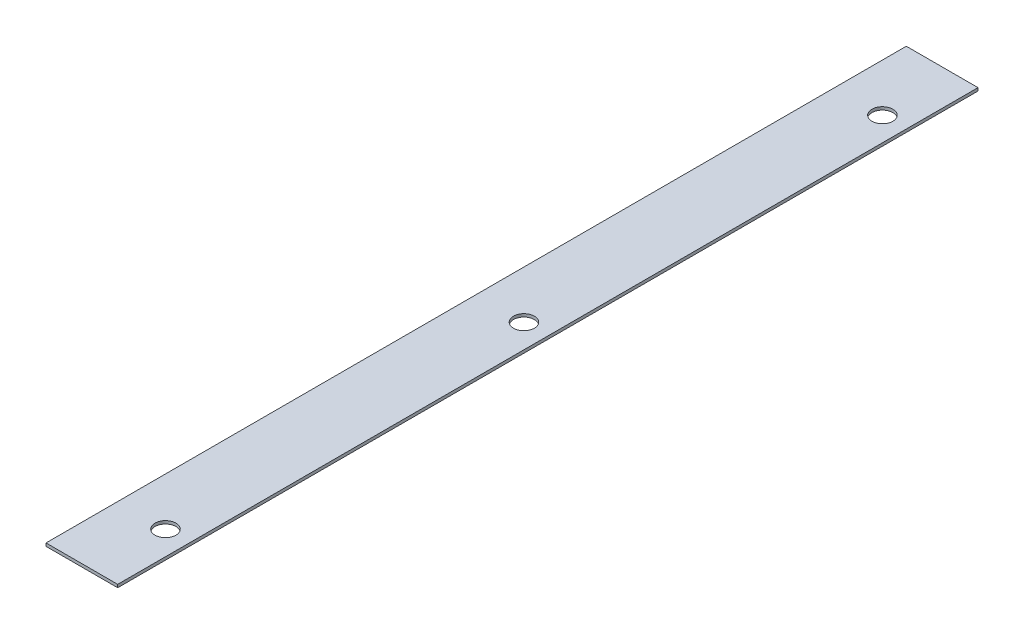
ISO-10303-21;
HEADER;
FILE_DESCRIPTION(('STEP AP214'),'2;1');
FILE_NAME('part.step','',(''),(''),'','','');
FILE_SCHEMA(('AUTOMOTIVE_DESIGN { 1 0 10303 214 1 1 1 1 }'));
ENDSEC;
DATA;
#1=APPLICATION_CONTEXT('core data for automotive mechanical design processes');
#2=APPLICATION_PROTOCOL_DEFINITION('international standard','automotive_design',2000,#1);
#3=PRODUCT_CONTEXT('',#1,'mechanical');
#4=PRODUCT('Part','Part','',(#3));
#5=PRODUCT_RELATED_PRODUCT_CATEGORY('part','',(#4));
#6=PRODUCT_DEFINITION_FORMATION('','',#4);
#7=PRODUCT_DEFINITION_CONTEXT('part definition',#1,'design');
#8=PRODUCT_DEFINITION('design','',#6,#7);
#9=PRODUCT_DEFINITION_SHAPE('','',#8);
#10=(LENGTH_UNIT() NAMED_UNIT(*) SI_UNIT(.MILLI.,.METRE.));
#11=(NAMED_UNIT(*) PLANE_ANGLE_UNIT() SI_UNIT($,.RADIAN.));
#12=(NAMED_UNIT(*) SI_UNIT($,.STERADIAN.) SOLID_ANGLE_UNIT());
#13=UNCERTAINTY_MEASURE_WITH_UNIT(LENGTH_MEASURE(1.E-05),#10,'distance_accuracy_value','');
#14=(GEOMETRIC_REPRESENTATION_CONTEXT(3) GLOBAL_UNCERTAINTY_ASSIGNED_CONTEXT((#13)) GLOBAL_UNIT_ASSIGNED_CONTEXT((#10,
#11,#12)) REPRESENTATION_CONTEXT('',''));
#15=CARTESIAN_POINT('',(0.,0.,0.));
#16=DIRECTION('',(0.,0.,1.));
#17=DIRECTION('',(1.,0.,0.));
#18=AXIS2_PLACEMENT_3D('',#15,#16,#17);
#19=CARTESIAN_POINT('',(0.,3.175,0.));
#20=DIRECTION('',(1.,0.,0.));
#21=DIRECTION('',(0.,0.,-1.));
#22=AXIS2_PLACEMENT_3D('',#19,#20,#21);
#23=PLANE('',#22);
#24=DIRECTION('',(0.,0.,1.));
#25=VECTOR('',#24,1.);
#26=CARTESIAN_POINT('',(0.,0.,0.));
#27=LINE('',#26,#25);
#28=CARTESIAN_POINT('',(0.,0.,-914.4));
#29=VERTEX_POINT('',#28);
#30=CARTESIAN_POINT('',(0.,0.,0.));
#31=VERTEX_POINT('',#30);
#32=EDGE_CURVE('E97',#29,#31,#27,.T.);
#33=ORIENTED_EDGE('',*,*,#32,.T.);
#34=DIRECTION('',(0.,-1.,0.));
#35=VECTOR('',#34,1.);
#36=CARTESIAN_POINT('',(0.,3.175,0.));
#37=LINE('',#36,#35);
#38=CARTESIAN_POINT('',(0.,3.175,0.));
#39=VERTEX_POINT('',#38);
#40=EDGE_CURVE('E11',#39,#31,#37,.T.);
#41=ORIENTED_EDGE('',*,*,#40,.F.);
#42=DIRECTION('',(0.,0.,1.));
#43=VECTOR('',#42,1.);
#44=CARTESIAN_POINT('',(0.,3.175,0.));
#45=LINE('',#44,#43);
#46=CARTESIAN_POINT('',(0.,3.175,-914.4));
#47=VERTEX_POINT('',#46);
#48=EDGE_CURVE('E85',#47,#39,#45,.T.);
#49=ORIENTED_EDGE('',*,*,#48,.F.);
#50=DIRECTION('',(0.,-1.,0.));
#51=VECTOR('',#50,1.);
#52=CARTESIAN_POINT('',(0.,3.175,-914.4));
#53=LINE('',#52,#51);
#54=EDGE_CURVE('E93',#47,#29,#53,.T.);
#55=ORIENTED_EDGE('',*,*,#54,.T.);
#56=EDGE_LOOP('',(#33,#41,#49,#55));
#57=FACE_BOUND('',#56,.T.);
#58=ADVANCED_FACE('F34',(#57),#23,.F.);
#59=CARTESIAN_POINT('',(0.,3.175,0.));
#60=DIRECTION('',(0.,0.,-1.));
#61=DIRECTION('',(-1.,0.,0.));
#62=AXIS2_PLACEMENT_3D('',#59,#60,#61);
#63=PLANE('',#62);
#64=DIRECTION('',(1.,0.,0.));
#65=VECTOR('',#64,1.);
#66=CARTESIAN_POINT('',(0.,0.,0.));
#67=LINE('',#66,#65);
#68=CARTESIAN_POINT('',(76.2,0.,0.));
#69=VERTEX_POINT('',#68);
#70=EDGE_CURVE('E89',#31,#69,#67,.T.);
#71=ORIENTED_EDGE('',*,*,#70,.T.);
#72=DIRECTION('',(0.,-1.,0.));
#73=VECTOR('',#72,1.);
#74=CARTESIAN_POINT('',(76.2,3.175,0.));
#75=LINE('',#74,#73);
#76=CARTESIAN_POINT('',(76.2,3.175,0.));
#77=VERTEX_POINT('',#76);
#78=EDGE_CURVE('E42',#77,#69,#75,.T.);
#79=ORIENTED_EDGE('',*,*,#78,.F.);
#80=DIRECTION('',(1.,0.,0.));
#81=VECTOR('',#80,1.);
#82=CARTESIAN_POINT('',(0.,3.175,0.));
#83=LINE('',#82,#81);
#84=EDGE_CURVE('E80',#39,#77,#83,.T.);
#85=ORIENTED_EDGE('',*,*,#84,.F.);
#86=ORIENTED_EDGE('',*,*,#40,.T.);
#87=EDGE_LOOP('',(#71,#79,#85,#86));
#88=FACE_BOUND('',#87,.T.);
#89=ADVANCED_FACE('F88',(#88),#63,.F.);
#90=CARTESIAN_POINT('',(76.2,3.175,0.));
#91=DIRECTION('',(-1.,0.,0.));
#92=DIRECTION('',(0.,0.,1.));
#93=AXIS2_PLACEMENT_3D('',#90,#91,#92);
#94=PLANE('',#93);
#95=DIRECTION('',(0.,0.,-1.));
#96=VECTOR('',#95,1.);
#97=CARTESIAN_POINT('',(76.2,0.,0.));
#98=LINE('',#97,#96);
#99=CARTESIAN_POINT('',(76.2,0.,-914.4));
#100=VERTEX_POINT('',#99);
#101=EDGE_CURVE('E67',#69,#100,#98,.T.);
#102=ORIENTED_EDGE('',*,*,#101,.T.);
#103=DIRECTION('',(0.,-1.,0.));
#104=VECTOR('',#103,1.);
#105=CARTESIAN_POINT('',(76.2,3.175,-914.4));
#106=LINE('',#105,#104);
#107=CARTESIAN_POINT('',(76.2,3.175,-914.4));
#108=VERTEX_POINT('',#107);
#109=EDGE_CURVE('E90',#108,#100,#106,.T.);
#110=ORIENTED_EDGE('',*,*,#109,.F.);
#111=DIRECTION('',(0.,0.,-1.));
#112=VECTOR('',#111,1.);
#113=CARTESIAN_POINT('',(76.2,3.175,0.));
#114=LINE('',#113,#112);
#115=EDGE_CURVE('E83',#77,#108,#114,.T.);
#116=ORIENTED_EDGE('',*,*,#115,.F.);
#117=ORIENTED_EDGE('',*,*,#78,.T.);
#118=EDGE_LOOP('',(#102,#110,#116,#117));
#119=FACE_BOUND('',#118,.T.);
#120=ADVANCED_FACE('F91',(#119),#94,.F.);
#121=CARTESIAN_POINT('',(0.,3.175,-914.4));
#122=DIRECTION('',(0.,0.,1.));
#123=DIRECTION('',(1.,0.,0.));
#124=AXIS2_PLACEMENT_3D('',#121,#122,#123);
#125=PLANE('',#124);
#126=DIRECTION('',(-1.,0.,0.));
#127=VECTOR('',#126,1.);
#128=CARTESIAN_POINT('',(0.,0.,-914.4));
#129=LINE('',#128,#127);
#130=EDGE_CURVE('E73',#100,#29,#129,.T.);
#131=ORIENTED_EDGE('',*,*,#130,.T.);
#132=ORIENTED_EDGE('',*,*,#54,.F.);
#133=DIRECTION('',(-1.,0.,0.));
#134=VECTOR('',#133,1.);
#135=CARTESIAN_POINT('',(0.,3.175,-914.4));
#136=LINE('',#135,#134);
#137=EDGE_CURVE('E50',#108,#47,#136,.T.);
#138=ORIENTED_EDGE('',*,*,#137,.F.);
#139=ORIENTED_EDGE('',*,*,#109,.T.);
#140=EDGE_LOOP('',(#131,#132,#138,#139));
#141=FACE_BOUND('',#140,.T.);
#142=ADVANCED_FACE('F105',(#141),#125,.F.);
#143=CARTESIAN_POINT('',(0.,3.175,-914.4));
#144=DIRECTION('',(0.,-1.,0.));
#145=DIRECTION('',(0.,0.,-1.));
#146=AXIS2_PLACEMENT_3D('',#143,#144,#145);
#147=PLANE('',#146);
#148=CARTESIAN_POINT('',(50.7999999999976,3.175,-76.1999999999999));
#149=DIRECTION('',(0.,1.,0.));
#150=DIRECTION('',(0.,0.,-1.));
#151=AXIS2_PLACEMENT_3D('',#148,#149,#150);
#152=CIRCLE('',#151,11.1125);
#153=CARTESIAN_POINT('',(50.7999999999976,3.175,-87.3124999999999));
#154=VERTEX_POINT('',#153);
#155=EDGE_CURVE('E120',#154,#154,#152,.T.);
#156=ORIENTED_EDGE('',*,*,#155,.F.);
#157=EDGE_LOOP('',(#156));
#158=FACE_BOUND('',#157,.T.);
#159=CARTESIAN_POINT('',(50.7999999999998,3.175,-457.2));
#160=DIRECTION('',(0.,1.,0.));
#161=DIRECTION('',(0.,0.,1.));
#162=AXIS2_PLACEMENT_3D('',#159,#160,#161);
#163=CIRCLE('',#162,11.1125);
#164=CARTESIAN_POINT('',(50.7999999999998,3.175,-446.0875));
#165=VERTEX_POINT('',#164);
#166=EDGE_CURVE('E114',#165,#165,#163,.T.);
#167=ORIENTED_EDGE('',*,*,#166,.F.);
#168=EDGE_LOOP('',(#167));
#169=FACE_BOUND('',#168,.T.);
#170=CARTESIAN_POINT('',(50.7999999999998,3.175,-838.2));
#171=DIRECTION('',(0.,1.,0.));
#172=DIRECTION('',(0.,0.,1.));
#173=AXIS2_PLACEMENT_3D('',#170,#171,#172);
#174=CIRCLE('',#173,11.1125);
#175=CARTESIAN_POINT('',(50.7999999999998,3.175,-827.0875));
#176=VERTEX_POINT('',#175);
#177=EDGE_CURVE('E100',#176,#176,#174,.T.);
#178=ORIENTED_EDGE('',*,*,#177,.F.);
#179=EDGE_LOOP('',(#178));
#180=FACE_BOUND('',#179,.T.);
#181=ORIENTED_EDGE('',*,*,#48,.T.);
#182=ORIENTED_EDGE('',*,*,#84,.T.);
#183=ORIENTED_EDGE('',*,*,#115,.T.);
#184=ORIENTED_EDGE('',*,*,#137,.T.);
#185=EDGE_LOOP('',(#181,#182,#183,#184));
#186=FACE_BOUND('',#185,.T.);
#187=ADVANCED_FACE('F81',(#158,#169,#180,#186),#147,.F.);
#188=CARTESIAN_POINT('',(0.,0.,-914.4));
#189=DIRECTION('',(0.,-1.,0.));
#190=DIRECTION('',(0.,0.,-1.));
#191=AXIS2_PLACEMENT_3D('',#188,#189,#190);
#192=PLANE('',#191);
#193=CARTESIAN_POINT('',(50.7999999999976,0.,-76.1999999999999));
#194=DIRECTION('',(0.,-1.,0.));
#195=DIRECTION('',(0.,0.,-1.));
#196=AXIS2_PLACEMENT_3D('',#193,#194,#195);
#197=CIRCLE('',#196,11.1125);
#198=CARTESIAN_POINT('',(50.7999999999976,0.,-87.3124999999999));
#199=VERTEX_POINT('',#198);
#200=EDGE_CURVE('E123',#199,#199,#197,.F.);
#201=ORIENTED_EDGE('',*,*,#200,.T.);
#202=EDGE_LOOP('',(#201));
#203=FACE_BOUND('',#202,.T.);
#204=CARTESIAN_POINT('',(50.7999999999998,0.,-457.2));
#205=DIRECTION('',(0.,-1.,0.));
#206=DIRECTION('',(0.,0.,-1.));
#207=AXIS2_PLACEMENT_3D('',#204,#205,#206);
#208=CIRCLE('',#207,11.1125);
#209=CARTESIAN_POINT('',(50.7999999999998,0.,-468.3125));
#210=VERTEX_POINT('',#209);
#211=EDGE_CURVE('E117',#210,#210,#208,.F.);
#212=ORIENTED_EDGE('',*,*,#211,.T.);
#213=EDGE_LOOP('',(#212));
#214=FACE_BOUND('',#213,.T.);
#215=CARTESIAN_POINT('',(50.7999999999998,0.,-838.2));
#216=DIRECTION('',(0.,-1.,0.));
#217=DIRECTION('',(0.,0.,-1.));
#218=AXIS2_PLACEMENT_3D('',#215,#216,#217);
#219=CIRCLE('',#218,11.1125);
#220=CARTESIAN_POINT('',(50.7999999999998,0.,-849.3125));
#221=VERTEX_POINT('',#220);
#222=EDGE_CURVE('E111',#221,#221,#219,.F.);
#223=ORIENTED_EDGE('',*,*,#222,.T.);
#224=EDGE_LOOP('',(#223));
#225=FACE_BOUND('',#224,.T.);
#226=ORIENTED_EDGE('',*,*,#32,.F.);
#227=ORIENTED_EDGE('',*,*,#130,.F.);
#228=ORIENTED_EDGE('',*,*,#101,.F.);
#229=ORIENTED_EDGE('',*,*,#70,.F.);
#230=EDGE_LOOP('',(#226,#227,#228,#229));
#231=FACE_BOUND('',#230,.T.);
#232=ADVANCED_FACE('F108',(#203,#214,#225,#231),#192,.T.);
#233=CARTESIAN_POINT('',(50.7999999999998,-0.00100000000000013,-838.2));
#234=DIRECTION('',(0.,1.,0.));
#235=DIRECTION('',(0.,0.,1.));
#236=AXIS2_PLACEMENT_3D('',#233,#234,#235);
#237=CYLINDRICAL_SURFACE('',#236,11.1125);
#238=ORIENTED_EDGE('',*,*,#222,.F.);
#239=EDGE_LOOP('',(#238));
#240=FACE_BOUND('',#239,.T.);
#241=ORIENTED_EDGE('',*,*,#177,.T.);
#242=EDGE_LOOP('',(#241));
#243=FACE_BOUND('',#242,.T.);
#244=ADVANCED_FACE('F138',(#240,#243),#237,.F.);
#245=CARTESIAN_POINT('',(50.7999999999998,-0.00100000000000013,-457.2));
#246=DIRECTION('',(0.,1.,0.));
#247=DIRECTION('',(0.,0.,1.));
#248=AXIS2_PLACEMENT_3D('',#245,#246,#247);
#249=CYLINDRICAL_SURFACE('',#248,11.1125);
#250=ORIENTED_EDGE('',*,*,#211,.F.);
#251=EDGE_LOOP('',(#250));
#252=FACE_BOUND('',#251,.T.);
#253=ORIENTED_EDGE('',*,*,#166,.T.);
#254=EDGE_LOOP('',(#253));
#255=FACE_BOUND('',#254,.T.);
#256=ADVANCED_FACE('F140',(#252,#255),#249,.F.);
#257=CARTESIAN_POINT('',(50.7999999999976,-0.00100000000000013,-76.1999999999999));
#258=DIRECTION('',(0.,1.,0.));
#259=DIRECTION('',(0.,0.,1.));
#260=AXIS2_PLACEMENT_3D('',#257,#258,#259);
#261=CYLINDRICAL_SURFACE('',#260,11.1125);
#262=ORIENTED_EDGE('',*,*,#200,.F.);
#263=EDGE_LOOP('',(#262));
#264=FACE_BOUND('',#263,.T.);
#265=ORIENTED_EDGE('',*,*,#155,.T.);
#266=EDGE_LOOP('',(#265));
#267=FACE_BOUND('',#266,.T.);
#268=ADVANCED_FACE('F129',(#264,#267),#261,.F.);
#269=CLOSED_SHELL('',(#58,#89,#120,#142,#187,#232,#244,#256,#268));
#270=MANIFOLD_SOLID_BREP('B2',#269);
#271=ADVANCED_BREP_SHAPE_REPRESENTATION('',(#18,#270),#14);
#272=SHAPE_DEFINITION_REPRESENTATION(#9,#271);
ENDSEC;
END-ISO-10303-21;
